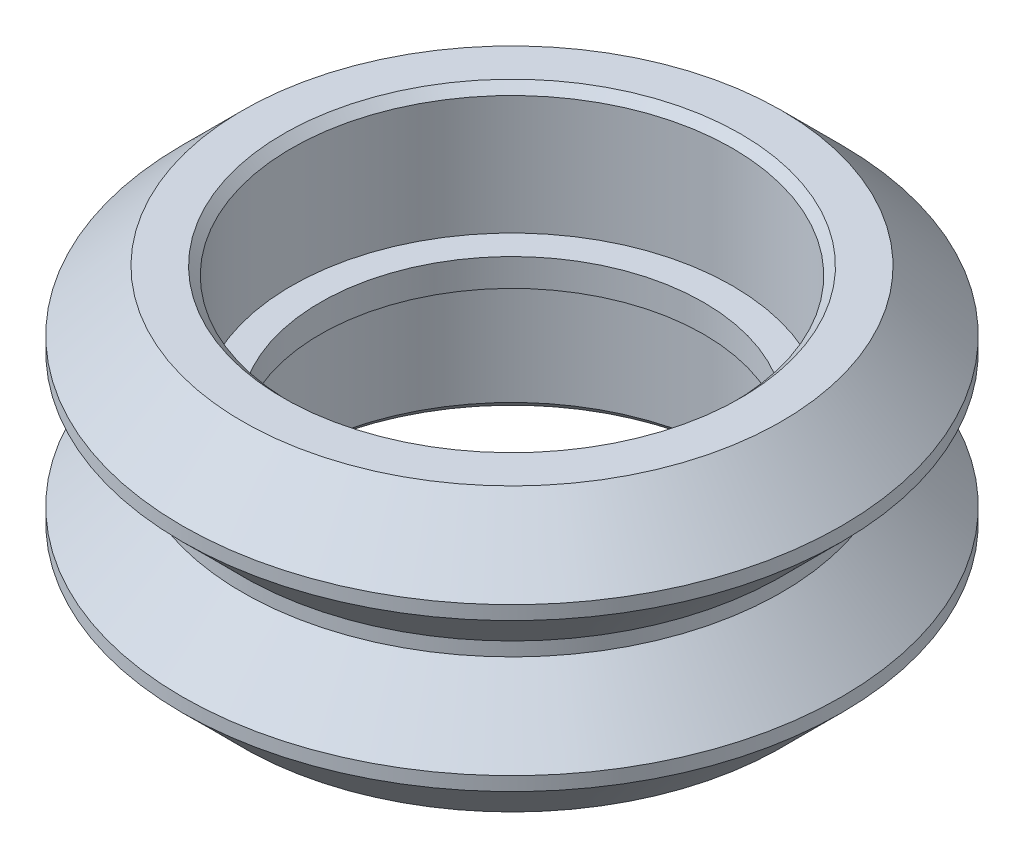
ISO-10303-21;
HEADER;
FILE_DESCRIPTION(('STEP AP214'),'2;1');
FILE_NAME('part.step','',(''),(''),'','','');
FILE_SCHEMA(('AUTOMOTIVE_DESIGN { 1 0 10303 214 1 1 1 1 }'));
ENDSEC;
DATA;
#1=APPLICATION_CONTEXT('core data for automotive mechanical design processes');
#2=APPLICATION_PROTOCOL_DEFINITION('international standard','automotive_design',2000,#1);
#3=PRODUCT_CONTEXT('',#1,'mechanical');
#4=PRODUCT('Part','Part','',(#3));
#5=PRODUCT_RELATED_PRODUCT_CATEGORY('part','',(#4));
#6=PRODUCT_DEFINITION_FORMATION('','',#4);
#7=PRODUCT_DEFINITION_CONTEXT('part definition',#1,'design');
#8=PRODUCT_DEFINITION('design','',#6,#7);
#9=PRODUCT_DEFINITION_SHAPE('','',#8);
#10=(LENGTH_UNIT() NAMED_UNIT(*) SI_UNIT(.MILLI.,.METRE.));
#11=(NAMED_UNIT(*) PLANE_ANGLE_UNIT() SI_UNIT($,.RADIAN.));
#12=(NAMED_UNIT(*) SI_UNIT($,.STERADIAN.) SOLID_ANGLE_UNIT());
#13=UNCERTAINTY_MEASURE_WITH_UNIT(LENGTH_MEASURE(1.E-05),#10,'distance_accuracy_value','');
#14=(GEOMETRIC_REPRESENTATION_CONTEXT(3) GLOBAL_UNCERTAINTY_ASSIGNED_CONTEXT((#13)) GLOBAL_UNIT_ASSIGNED_CONTEXT((#10,
#11,#12)) REPRESENTATION_CONTEXT('',''));
#15=CARTESIAN_POINT('',(0.,0.,0.));
#16=DIRECTION('',(0.,0.,1.));
#17=DIRECTION('',(1.,0.,0.));
#18=AXIS2_PLACEMENT_3D('',#15,#16,#17);
#19=CARTESIAN_POINT('',(0.,8.0475,0.));
#20=DIRECTION('',(0.,-1.,0.));
#21=DIRECTION('',(0.,0.,-1.));
#22=AXIS2_PLACEMENT_3D('',#19,#20,#21);
#23=CONICAL_SURFACE('',#22,11.945,0.785398163397447);
#24=CARTESIAN_POINT('',(0.,10.23,0.));
#25=DIRECTION('',(0.,-1.,0.));
#26=DIRECTION('',(0.,0.,-1.));
#27=AXIS2_PLACEMENT_3D('',#24,#25,#26);
#28=CIRCLE('',#27,9.7625);
#29=CARTESIAN_POINT('',(0.,10.23,-9.7625));
#30=VERTEX_POINT('',#29);
#31=EDGE_CURVE('E84',#30,#30,#28,.T.);
#32=ORIENTED_EDGE('',*,*,#31,.T.);
#33=EDGE_LOOP('',(#32));
#34=FACE_BOUND('',#33,.T.);
#35=CARTESIAN_POINT('',(0.,8.0475,0.));
#36=DIRECTION('',(0.,-1.,0.));
#37=DIRECTION('',(0.,0.,-1.));
#38=AXIS2_PLACEMENT_3D('',#35,#36,#37);
#39=CIRCLE('',#38,11.945);
#40=CARTESIAN_POINT('',(0.,8.0475,-11.945));
#41=VERTEX_POINT('',#40);
#42=EDGE_CURVE('E10',#41,#41,#39,.T.);
#43=ORIENTED_EDGE('',*,*,#42,.F.);
#44=EDGE_LOOP('',(#43));
#45=FACE_BOUND('',#44,.T.);
#46=ADVANCED_FACE('F32',(#34,#45),#23,.T.);
#47=CARTESIAN_POINT('',(0.,0.,0.));
#48=DIRECTION('',(0.,-1.,0.));
#49=DIRECTION('',(0.,0.,-1.));
#50=AXIS2_PLACEMENT_3D('',#47,#48,#49);
#51=CYLINDRICAL_SURFACE('',#50,11.945);
#52=ORIENTED_EDGE('',*,*,#42,.T.);
#53=EDGE_LOOP('',(#52));
#54=FACE_BOUND('',#53,.T.);
#55=CARTESIAN_POINT('',(0.,7.54749999999999,0.));
#56=DIRECTION('',(0.,-1.,0.));
#57=DIRECTION('',(0.,0.,-1.));
#58=AXIS2_PLACEMENT_3D('',#55,#56,#57);
#59=CIRCLE('',#58,11.945);
#60=CARTESIAN_POINT('',(0.,7.54749999999999,-11.945));
#61=VERTEX_POINT('',#60);
#62=EDGE_CURVE('E38',#61,#61,#59,.T.);
#63=ORIENTED_EDGE('',*,*,#62,.F.);
#64=EDGE_LOOP('',(#63));
#65=FACE_BOUND('',#64,.T.);
#66=ADVANCED_FACE('F102',(#54,#65),#51,.T.);
#67=CARTESIAN_POINT('',(0.,5.365,0.));
#68=DIRECTION('',(0.,1.,0.));
#69=DIRECTION('',(0.,0.,1.));
#70=AXIS2_PLACEMENT_3D('',#67,#68,#69);
#71=CONICAL_SURFACE('',#70,9.7625,0.78539816339745);
#72=ORIENTED_EDGE('',*,*,#62,.T.);
#73=EDGE_LOOP('',(#72));
#74=FACE_BOUND('',#73,.T.);
#75=CARTESIAN_POINT('',(0.,5.365,0.));
#76=DIRECTION('',(0.,-1.,0.));
#77=DIRECTION('',(0.,0.,-1.));
#78=AXIS2_PLACEMENT_3D('',#75,#76,#77);
#79=CIRCLE('',#78,9.7625);
#80=CARTESIAN_POINT('',(0.,5.365,-9.7625));
#81=VERTEX_POINT('',#80);
#82=EDGE_CURVE('E42',#81,#81,#79,.T.);
#83=ORIENTED_EDGE('',*,*,#82,.F.);
#84=EDGE_LOOP('',(#83));
#85=FACE_BOUND('',#84,.T.);
#86=ADVANCED_FACE('F106',(#74,#85),#71,.T.);
#87=CARTESIAN_POINT('',(0.,0.,0.));
#88=DIRECTION('',(0.,-1.,0.));
#89=DIRECTION('',(0.,0.,-1.));
#90=AXIS2_PLACEMENT_3D('',#87,#88,#89);
#91=CYLINDRICAL_SURFACE('',#90,9.7625);
#92=ORIENTED_EDGE('',*,*,#82,.T.);
#93=EDGE_LOOP('',(#92));
#94=FACE_BOUND('',#93,.T.);
#95=CARTESIAN_POINT('',(0.,4.865,0.));
#96=DIRECTION('',(0.,-1.,0.));
#97=DIRECTION('',(0.,0.,-1.));
#98=AXIS2_PLACEMENT_3D('',#95,#96,#97);
#99=CIRCLE('',#98,9.7625);
#100=CARTESIAN_POINT('',(0.,4.865,-9.7625));
#101=VERTEX_POINT('',#100);
#102=EDGE_CURVE('E46',#101,#101,#99,.T.);
#103=ORIENTED_EDGE('',*,*,#102,.F.);
#104=EDGE_LOOP('',(#103));
#105=FACE_BOUND('',#104,.T.);
#106=ADVANCED_FACE('F110',(#94,#105),#91,.T.);
#107=CARTESIAN_POINT('',(0.,2.68250000000001,0.));
#108=DIRECTION('',(0.,-1.,0.));
#109=DIRECTION('',(0.,0.,-1.));
#110=AXIS2_PLACEMENT_3D('',#107,#108,#109);
#111=CONICAL_SURFACE('',#110,11.945,0.78539816339745);
#112=ORIENTED_EDGE('',*,*,#102,.T.);
#113=EDGE_LOOP('',(#112));
#114=FACE_BOUND('',#113,.T.);
#115=CARTESIAN_POINT('',(0.,2.68250000000001,0.));
#116=DIRECTION('',(0.,-1.,0.));
#117=DIRECTION('',(0.,0.,-1.));
#118=AXIS2_PLACEMENT_3D('',#115,#116,#117);
#119=CIRCLE('',#118,11.945);
#120=CARTESIAN_POINT('',(0.,2.68250000000001,-11.945));
#121=VERTEX_POINT('',#120);
#122=EDGE_CURVE('E51',#121,#121,#119,.T.);
#123=ORIENTED_EDGE('',*,*,#122,.F.);
#124=EDGE_LOOP('',(#123));
#125=FACE_BOUND('',#124,.T.);
#126=ADVANCED_FACE('F116',(#114,#125),#111,.T.);
#127=CARTESIAN_POINT('',(0.,0.,0.));
#128=DIRECTION('',(0.,-1.,0.));
#129=DIRECTION('',(0.,0.,-1.));
#130=AXIS2_PLACEMENT_3D('',#127,#128,#129);
#131=CYLINDRICAL_SURFACE('',#130,11.945);
#132=ORIENTED_EDGE('',*,*,#122,.T.);
#133=EDGE_LOOP('',(#132));
#134=FACE_BOUND('',#133,.T.);
#135=CARTESIAN_POINT('',(0.,2.1825,0.));
#136=DIRECTION('',(0.,-1.,0.));
#137=DIRECTION('',(0.,0.,-1.));
#138=AXIS2_PLACEMENT_3D('',#135,#136,#137);
#139=CIRCLE('',#138,11.945);
#140=CARTESIAN_POINT('',(0.,2.1825,-11.945));
#141=VERTEX_POINT('',#140);
#142=EDGE_CURVE('E54',#141,#141,#139,.T.);
#143=ORIENTED_EDGE('',*,*,#142,.F.);
#144=EDGE_LOOP('',(#143));
#145=FACE_BOUND('',#144,.T.);
#146=ADVANCED_FACE('F120',(#134,#145),#131,.T.);
#147=CARTESIAN_POINT('',(0.,0.,0.));
#148=DIRECTION('',(0.,1.,0.));
#149=DIRECTION('',(0.,0.,1.));
#150=AXIS2_PLACEMENT_3D('',#147,#148,#149);
#151=CONICAL_SURFACE('',#150,9.7625,0.785398163397447);
#152=ORIENTED_EDGE('',*,*,#142,.T.);
#153=EDGE_LOOP('',(#152));
#154=FACE_BOUND('',#153,.T.);
#155=CARTESIAN_POINT('',(0.,0.,0.));
#156=DIRECTION('',(0.,-1.,0.));
#157=DIRECTION('',(0.,0.,-1.));
#158=AXIS2_PLACEMENT_3D('',#155,#156,#157);
#159=CIRCLE('',#158,9.7625);
#160=CARTESIAN_POINT('',(0.,0.,-9.7625));
#161=VERTEX_POINT('',#160);
#162=EDGE_CURVE('E57',#161,#161,#159,.T.);
#163=ORIENTED_EDGE('',*,*,#162,.F.);
#164=EDGE_LOOP('',(#163));
#165=FACE_BOUND('',#164,.T.);
#166=ADVANCED_FACE('F124',(#154,#165),#151,.T.);
#167=CARTESIAN_POINT('',(8.287,0.,0.));
#168=DIRECTION('',(0.,-1.,0.));
#169=DIRECTION('',(0.,0.,-1.));
#170=AXIS2_PLACEMENT_3D('',#167,#168,#169);
#171=PLANE('',#170);
#172=ORIENTED_EDGE('',*,*,#162,.T.);
#173=EDGE_LOOP('',(#172));
#174=FACE_BOUND('',#173,.T.);
#175=CARTESIAN_POINT('',(0.,0.,0.));
#176=DIRECTION('',(0.,-1.,0.));
#177=DIRECTION('',(0.,0.,-1.));
#178=AXIS2_PLACEMENT_3D('',#175,#176,#177);
#179=CIRCLE('',#178,8.287);
#180=CARTESIAN_POINT('',(0.,0.,-8.287));
#181=VERTEX_POINT('',#180);
#182=EDGE_CURVE('E60',#181,#181,#179,.T.);
#183=ORIENTED_EDGE('',*,*,#182,.F.);
#184=EDGE_LOOP('',(#183));
#185=FACE_BOUND('',#184,.T.);
#186=ADVANCED_FACE('F128',(#174,#185),#171,.T.);
#187=CARTESIAN_POINT('',(0.,0.3,0.));
#188=DIRECTION('',(0.,-1.,0.));
#189=DIRECTION('',(0.,0.,-1.));
#190=AXIS2_PLACEMENT_3D('',#187,#188,#189);
#191=CONICAL_SURFACE('',#190,7.987,0.785398163397448);
#192=ORIENTED_EDGE('',*,*,#182,.T.);
#193=EDGE_LOOP('',(#192));
#194=FACE_BOUND('',#193,.T.);
#195=CARTESIAN_POINT('',(0.,0.3,0.));
#196=DIRECTION('',(0.,-1.,0.));
#197=DIRECTION('',(0.,0.,-1.));
#198=AXIS2_PLACEMENT_3D('',#195,#196,#197);
#199=CIRCLE('',#198,7.987);
#200=CARTESIAN_POINT('',(0.,0.3,-7.987));
#201=VERTEX_POINT('',#200);
#202=EDGE_CURVE('E63',#201,#201,#199,.T.);
#203=ORIENTED_EDGE('',*,*,#202,.F.);
#204=EDGE_LOOP('',(#203));
#205=FACE_BOUND('',#204,.T.);
#206=ADVANCED_FACE('F132',(#194,#205),#191,.F.);
#207=CARTESIAN_POINT('',(0.,0.,0.));
#208=DIRECTION('',(0.,-1.,0.));
#209=DIRECTION('',(0.,0.,-1.));
#210=AXIS2_PLACEMENT_3D('',#207,#208,#209);
#211=CYLINDRICAL_SURFACE('',#210,7.987);
#212=ORIENTED_EDGE('',*,*,#202,.T.);
#213=EDGE_LOOP('',(#212));
#214=FACE_BOUND('',#213,.T.);
#215=CARTESIAN_POINT('',(0.,4.615,0.));
#216=DIRECTION('',(0.,-1.,0.));
#217=DIRECTION('',(0.,0.,-1.));
#218=AXIS2_PLACEMENT_3D('',#215,#216,#217);
#219=CIRCLE('',#218,7.987);
#220=CARTESIAN_POINT('',(0.,4.615,-7.987));
#221=VERTEX_POINT('',#220);
#222=EDGE_CURVE('E66',#221,#221,#219,.T.);
#223=ORIENTED_EDGE('',*,*,#222,.F.);
#224=EDGE_LOOP('',(#223));
#225=FACE_BOUND('',#224,.T.);
#226=ADVANCED_FACE('F136',(#214,#225),#211,.F.);
#227=CARTESIAN_POINT('',(7.987,4.615,0.));
#228=DIRECTION('',(0.,-1.,0.));
#229=DIRECTION('',(0.,0.,-1.));
#230=AXIS2_PLACEMENT_3D('',#227,#228,#229);
#231=PLANE('',#230);
#232=ORIENTED_EDGE('',*,*,#222,.T.);
#233=EDGE_LOOP('',(#232));
#234=FACE_BOUND('',#233,.T.);
#235=CARTESIAN_POINT('',(0.,4.615,0.));
#236=DIRECTION('',(0.,-1.,0.));
#237=DIRECTION('',(0.,0.,-1.));
#238=AXIS2_PLACEMENT_3D('',#235,#236,#237);
#239=CIRCLE('',#238,6.945);
#240=CARTESIAN_POINT('',(0.,4.615,-6.945));
#241=VERTEX_POINT('',#240);
#242=EDGE_CURVE('E69',#241,#241,#239,.T.);
#243=ORIENTED_EDGE('',*,*,#242,.F.);
#244=EDGE_LOOP('',(#243));
#245=FACE_BOUND('',#244,.T.);
#246=ADVANCED_FACE('F140',(#234,#245),#231,.T.);
#247=CARTESIAN_POINT('',(0.,0.,0.));
#248=DIRECTION('',(0.,-1.,0.));
#249=DIRECTION('',(0.,0.,-1.));
#250=AXIS2_PLACEMENT_3D('',#247,#248,#249);
#251=CYLINDRICAL_SURFACE('',#250,6.945);
#252=ORIENTED_EDGE('',*,*,#242,.T.);
#253=EDGE_LOOP('',(#252));
#254=FACE_BOUND('',#253,.T.);
#255=CARTESIAN_POINT('',(0.,5.615,0.));
#256=DIRECTION('',(0.,-1.,0.));
#257=DIRECTION('',(0.,0.,-1.));
#258=AXIS2_PLACEMENT_3D('',#255,#256,#257);
#259=CIRCLE('',#258,6.945);
#260=CARTESIAN_POINT('',(0.,5.615,-6.945));
#261=VERTEX_POINT('',#260);
#262=EDGE_CURVE('E72',#261,#261,#259,.T.);
#263=ORIENTED_EDGE('',*,*,#262,.F.);
#264=EDGE_LOOP('',(#263));
#265=FACE_BOUND('',#264,.T.);
#266=ADVANCED_FACE('F144',(#254,#265),#251,.F.);
#267=CARTESIAN_POINT('',(7.987,5.615,0.));
#268=DIRECTION('',(0.,1.,0.));
#269=DIRECTION('',(0.,0.,1.));
#270=AXIS2_PLACEMENT_3D('',#267,#268,#269);
#271=PLANE('',#270);
#272=ORIENTED_EDGE('',*,*,#262,.T.);
#273=EDGE_LOOP('',(#272));
#274=FACE_BOUND('',#273,.T.);
#275=CARTESIAN_POINT('',(0.,5.615,0.));
#276=DIRECTION('',(0.,-1.,0.));
#277=DIRECTION('',(0.,0.,-1.));
#278=AXIS2_PLACEMENT_3D('',#275,#276,#277);
#279=CIRCLE('',#278,7.987);
#280=CARTESIAN_POINT('',(0.,5.615,-7.987));
#281=VERTEX_POINT('',#280);
#282=EDGE_CURVE('E75',#281,#281,#279,.T.);
#283=ORIENTED_EDGE('',*,*,#282,.F.);
#284=EDGE_LOOP('',(#283));
#285=FACE_BOUND('',#284,.T.);
#286=ADVANCED_FACE('F148',(#274,#285),#271,.T.);
#287=CARTESIAN_POINT('',(0.,0.,0.));
#288=DIRECTION('',(0.,-1.,0.));
#289=DIRECTION('',(0.,0.,-1.));
#290=AXIS2_PLACEMENT_3D('',#287,#288,#289);
#291=CYLINDRICAL_SURFACE('',#290,7.987);
#292=ORIENTED_EDGE('',*,*,#282,.T.);
#293=EDGE_LOOP('',(#292));
#294=FACE_BOUND('',#293,.T.);
#295=CARTESIAN_POINT('',(0.,9.93,0.));
#296=DIRECTION('',(0.,-1.,0.));
#297=DIRECTION('',(0.,0.,-1.));
#298=AXIS2_PLACEMENT_3D('',#295,#296,#297);
#299=CIRCLE('',#298,7.987);
#300=CARTESIAN_POINT('',(0.,9.93,-7.987));
#301=VERTEX_POINT('',#300);
#302=EDGE_CURVE('E78',#301,#301,#299,.T.);
#303=ORIENTED_EDGE('',*,*,#302,.F.);
#304=EDGE_LOOP('',(#303));
#305=FACE_BOUND('',#304,.T.);
#306=ADVANCED_FACE('F98',(#294,#305),#291,.F.);
#307=CARTESIAN_POINT('',(0.,10.23,0.));
#308=DIRECTION('',(0.,1.,0.));
#309=DIRECTION('',(0.,0.,1.));
#310=AXIS2_PLACEMENT_3D('',#307,#308,#309);
#311=CONICAL_SURFACE('',#310,8.287,0.785398163397448);
#312=ORIENTED_EDGE('',*,*,#302,.T.);
#313=EDGE_LOOP('',(#312));
#314=FACE_BOUND('',#313,.T.);
#315=CARTESIAN_POINT('',(0.,10.23,0.));
#316=DIRECTION('',(0.,-1.,0.));
#317=DIRECTION('',(0.,0.,-1.));
#318=AXIS2_PLACEMENT_3D('',#315,#316,#317);
#319=CIRCLE('',#318,8.287);
#320=CARTESIAN_POINT('',(0.,10.23,-8.287));
#321=VERTEX_POINT('',#320);
#322=EDGE_CURVE('E81',#321,#321,#319,.T.);
#323=ORIENTED_EDGE('',*,*,#322,.F.);
#324=EDGE_LOOP('',(#323));
#325=FACE_BOUND('',#324,.T.);
#326=ADVANCED_FACE('F92',(#314,#325),#311,.F.);
#327=CARTESIAN_POINT('',(8.287,10.23,0.));
#328=DIRECTION('',(0.,1.,0.));
#329=DIRECTION('',(0.,0.,1.));
#330=AXIS2_PLACEMENT_3D('',#327,#328,#329);
#331=PLANE('',#330);
#332=ORIENTED_EDGE('',*,*,#322,.T.);
#333=EDGE_LOOP('',(#332));
#334=FACE_BOUND('',#333,.T.);
#335=ORIENTED_EDGE('',*,*,#31,.F.);
#336=EDGE_LOOP('',(#335));
#337=FACE_BOUND('',#336,.T.);
#338=ADVANCED_FACE('F90',(#334,#337),#331,.T.);
#339=CLOSED_SHELL('',(#46,#66,#86,#106,#126,#146,#166,#186,#206,#226,#246,#266,#286,#306,#326,#338));
#340=MANIFOLD_SOLID_BREP('B2',#339);
#341=ADVANCED_BREP_SHAPE_REPRESENTATION('',(#18,#340),#14);
#342=SHAPE_DEFINITION_REPRESENTATION(#9,#341);
ENDSEC;
END-ISO-10303-21;
